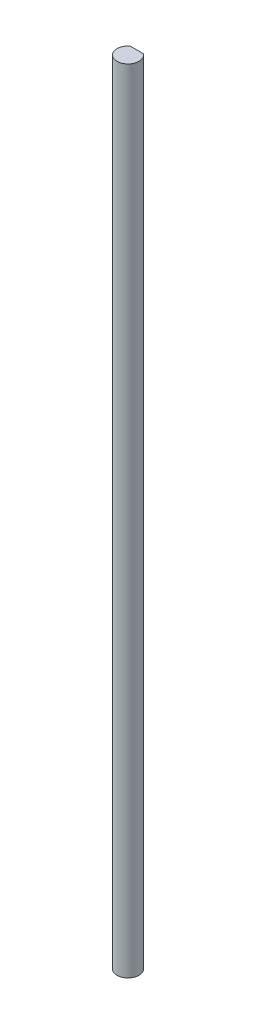
ISO-10303-21;
HEADER;
FILE_DESCRIPTION(('STEP AP214'),'2;1');
FILE_NAME('part.step','',(''),(''),'','','');
FILE_SCHEMA(('AUTOMOTIVE_DESIGN { 1 0 10303 214 1 1 1 1 }'));
ENDSEC;
DATA;
#1=APPLICATION_CONTEXT('core data for automotive mechanical design processes');
#2=APPLICATION_PROTOCOL_DEFINITION('international standard','automotive_design',2000,#1);
#3=PRODUCT_CONTEXT('',#1,'mechanical');
#4=PRODUCT('Part','Part','',(#3));
#5=PRODUCT_RELATED_PRODUCT_CATEGORY('part','',(#4));
#6=PRODUCT_DEFINITION_FORMATION('','',#4);
#7=PRODUCT_DEFINITION_CONTEXT('part definition',#1,'design');
#8=PRODUCT_DEFINITION('design','',#6,#7);
#9=PRODUCT_DEFINITION_SHAPE('','',#8);
#10=(LENGTH_UNIT() NAMED_UNIT(*) SI_UNIT(.MILLI.,.METRE.));
#11=(NAMED_UNIT(*) PLANE_ANGLE_UNIT() SI_UNIT($,.RADIAN.));
#12=(NAMED_UNIT(*) SI_UNIT($,.STERADIAN.) SOLID_ANGLE_UNIT());
#13=UNCERTAINTY_MEASURE_WITH_UNIT(LENGTH_MEASURE(1.E-05),#10,'distance_accuracy_value','');
#14=(GEOMETRIC_REPRESENTATION_CONTEXT(3) GLOBAL_UNCERTAINTY_ASSIGNED_CONTEXT((#13)) GLOBAL_UNIT_ASSIGNED_CONTEXT((#10,
#11,#12)) REPRESENTATION_CONTEXT('',''));
#15=CARTESIAN_POINT('',(0.,0.,0.));
#16=DIRECTION('',(0.,0.,1.));
#17=DIRECTION('',(1.,0.,0.));
#18=AXIS2_PLACEMENT_3D('',#15,#16,#17);
#19=CARTESIAN_POINT('',(0.,228.6,0.));
#20=DIRECTION('',(0.,-1.,0.));
#21=DIRECTION('',(0.,0.,-1.));
#22=AXIS2_PLACEMENT_3D('',#19,#20,#21);
#23=CYLINDRICAL_SURFACE('',#22,3.175);
#24=CARTESIAN_POINT('',(0.,0.,0.));
#25=DIRECTION('',(0.,1.,0.));
#26=DIRECTION('',(0.,0.,1.));
#27=AXIS2_PLACEMENT_3D('',#24,#25,#26);
#28=CIRCLE('',#27,3.175);
#29=CARTESIAN_POINT('',(-1.905,0.,-2.54));
#30=VERTEX_POINT('',#29);
#31=CARTESIAN_POINT('',(1.905,0.,-2.54));
#32=VERTEX_POINT('',#31);
#33=EDGE_CURVE('E64',#30,#32,#28,.T.);
#34=ORIENTED_EDGE('',*,*,#33,.T.);
#35=DIRECTION('',(0.,-1.,0.));
#36=VECTOR('',#35,1.);
#37=CARTESIAN_POINT('',(1.905,228.6,-2.54));
#38=LINE('',#37,#36);
#39=CARTESIAN_POINT('',(1.905,228.6,-2.54));
#40=VERTEX_POINT('',#39);
#41=EDGE_CURVE('E11',#40,#32,#38,.T.);
#42=ORIENTED_EDGE('',*,*,#41,.F.);
#43=CARTESIAN_POINT('',(0.,228.6,0.));
#44=DIRECTION('',(0.,1.,0.));
#45=DIRECTION('',(0.,0.,1.));
#46=AXIS2_PLACEMENT_3D('',#43,#44,#45);
#47=CIRCLE('',#46,3.175);
#48=CARTESIAN_POINT('',(-1.905,228.6,-2.54));
#49=VERTEX_POINT('',#48);
#50=EDGE_CURVE('E63',#49,#40,#47,.T.);
#51=ORIENTED_EDGE('',*,*,#50,.F.);
#52=DIRECTION('',(0.,-1.,0.));
#53=VECTOR('',#52,1.);
#54=CARTESIAN_POINT('',(-1.905,228.6,-2.54));
#55=LINE('',#54,#53);
#56=EDGE_CURVE('E41',#49,#30,#55,.T.);
#57=ORIENTED_EDGE('',*,*,#56,.T.);
#58=EDGE_LOOP('',(#34,#42,#51,#57));
#59=FACE_BOUND('',#58,.T.);
#60=ADVANCED_FACE('F33',(#59),#23,.T.);
#61=CARTESIAN_POINT('',(-1.905,228.6,-2.54));
#62=DIRECTION('',(0.,0.,1.));
#63=DIRECTION('',(1.,0.,0.));
#64=AXIS2_PLACEMENT_3D('',#61,#62,#63);
#65=PLANE('',#64);
#66=DIRECTION('',(-1.,0.,0.));
#67=VECTOR('',#66,1.);
#68=CARTESIAN_POINT('',(-1.905,0.,-2.54));
#69=LINE('',#68,#67);
#70=EDGE_CURVE('E56',#32,#30,#69,.T.);
#71=ORIENTED_EDGE('',*,*,#70,.T.);
#72=ORIENTED_EDGE('',*,*,#56,.F.);
#73=DIRECTION('',(-1.,0.,0.));
#74=VECTOR('',#73,1.);
#75=CARTESIAN_POINT('',(-1.905,228.6,-2.54));
#76=LINE('',#75,#74);
#77=EDGE_CURVE('E48',#40,#49,#76,.T.);
#78=ORIENTED_EDGE('',*,*,#77,.F.);
#79=ORIENTED_EDGE('',*,*,#41,.T.);
#80=EDGE_LOOP('',(#71,#72,#78,#79));
#81=FACE_BOUND('',#80,.T.);
#82=ADVANCED_FACE('F59',(#81),#65,.F.);
#83=CARTESIAN_POINT('',(0.,228.6,0.));
#84=DIRECTION('',(0.,1.,0.));
#85=DIRECTION('',(0.,0.,1.));
#86=AXIS2_PLACEMENT_3D('',#83,#84,#85);
#87=PLANE('',#86);
#88=ORIENTED_EDGE('',*,*,#50,.T.);
#89=ORIENTED_EDGE('',*,*,#77,.T.);
#90=EDGE_LOOP('',(#88,#89));
#91=FACE_BOUND('',#90,.T.);
#92=ADVANCED_FACE('F71',(#91),#87,.T.);
#93=CARTESIAN_POINT('',(0.,0.,0.));
#94=DIRECTION('',(0.,1.,0.));
#95=DIRECTION('',(0.,0.,1.));
#96=AXIS2_PLACEMENT_3D('',#93,#94,#95);
#97=PLANE('',#96);
#98=ORIENTED_EDGE('',*,*,#33,.F.);
#99=ORIENTED_EDGE('',*,*,#70,.F.);
#100=EDGE_LOOP('',(#98,#99));
#101=FACE_BOUND('',#100,.T.);
#102=ADVANCED_FACE('F67',(#101),#97,.F.);
#103=CLOSED_SHELL('',(#60,#82,#92,#102));
#104=MANIFOLD_SOLID_BREP('B2',#103);
#105=ADVANCED_BREP_SHAPE_REPRESENTATION('',(#18,#104),#14);
#106=SHAPE_DEFINITION_REPRESENTATION(#9,#105);
ENDSEC;
END-ISO-10303-21;
